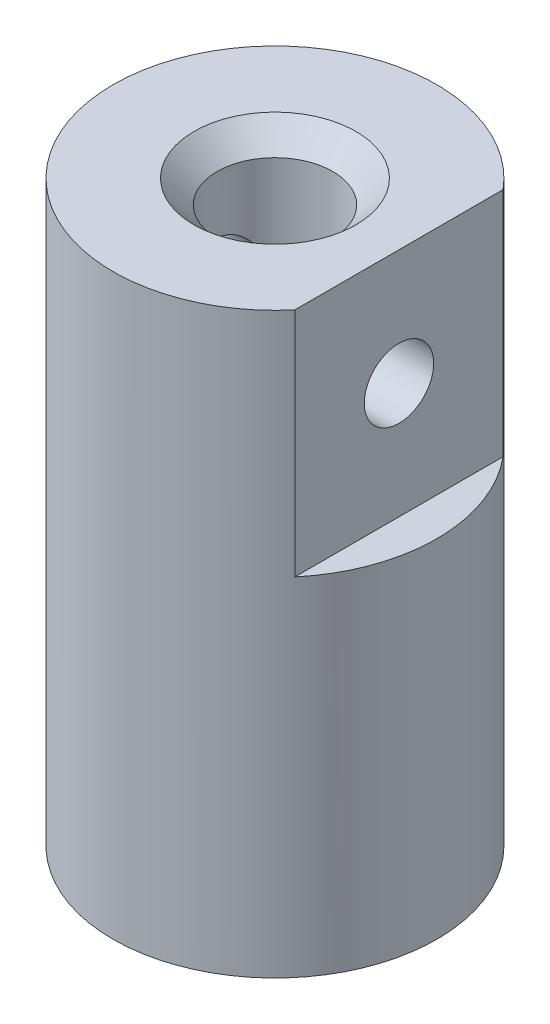
ISO-10303-21;
HEADER;
FILE_DESCRIPTION(('STEP AP214'),'2;1');
FILE_NAME('part.step','',(''),(''),'','','');
FILE_SCHEMA(('AUTOMOTIVE_DESIGN { 1 0 10303 214 1 1 1 1 }'));
ENDSEC;
DATA;
#1=APPLICATION_CONTEXT('core data for automotive mechanical design processes');
#2=APPLICATION_PROTOCOL_DEFINITION('international standard','automotive_design',2000,#1);
#3=PRODUCT_CONTEXT('',#1,'mechanical');
#4=PRODUCT('Part','Part','',(#3));
#5=PRODUCT_RELATED_PRODUCT_CATEGORY('part','',(#4));
#6=PRODUCT_DEFINITION_FORMATION('','',#4);
#7=PRODUCT_DEFINITION_CONTEXT('part definition',#1,'design');
#8=PRODUCT_DEFINITION('design','',#6,#7);
#9=PRODUCT_DEFINITION_SHAPE('','',#8);
#10=(LENGTH_UNIT() NAMED_UNIT(*) SI_UNIT(.MILLI.,.METRE.));
#11=(NAMED_UNIT(*) PLANE_ANGLE_UNIT() SI_UNIT($,.RADIAN.));
#12=(NAMED_UNIT(*) SI_UNIT($,.STERADIAN.) SOLID_ANGLE_UNIT());
#13=UNCERTAINTY_MEASURE_WITH_UNIT(LENGTH_MEASURE(1.E-05),#10,'distance_accuracy_value','');
#14=(GEOMETRIC_REPRESENTATION_CONTEXT(3) GLOBAL_UNCERTAINTY_ASSIGNED_CONTEXT((#13)) GLOBAL_UNIT_ASSIGNED_CONTEXT((#10,
#11,#12)) REPRESENTATION_CONTEXT('',''));
#15=CARTESIAN_POINT('',(0.,0.,0.));
#16=DIRECTION('',(0.,0.,1.));
#17=DIRECTION('',(1.,0.,0.));
#18=AXIS2_PLACEMENT_3D('',#15,#16,#17);
#19=CARTESIAN_POINT('',(0.,25.,0.));
#20=DIRECTION('',(0.,-1.,0.));
#21=DIRECTION('',(0.,0.,-1.));
#22=AXIS2_PLACEMENT_3D('',#19,#20,#21);
#23=CYLINDRICAL_SURFACE('',#22,7.);
#24=CARTESIAN_POINT('',(-7.,18.5,0.));
#25=CARTESIAN_POINT('',(-6.99999846043225,18.5000028995743,-0.0832358860906164));
#26=CARTESIAN_POINT('',(-6.9985002594971,18.5069516083879,-0.166507195600274));
#27=CARTESIAN_POINT('',(-6.99266829827728,18.5345356568536,-0.330687344293327));
#28=CARTESIAN_POINT('',(-6.98833245637099,18.5551810441949,-0.41159440357119));
#29=CARTESIAN_POINT('',(-6.97730831788826,18.609484364608,-0.568649323817737));
#30=CARTESIAN_POINT('',(-6.97062242967171,18.6431289793813,-0.644801963446556));
#31=CARTESIAN_POINT('',(-6.95562106817971,18.7224340861713,-0.790378177960788));
#32=CARTESIAN_POINT('',(-6.9473056503666,18.7680941692499,-0.85980198174737));
#33=CARTESIAN_POINT('',(-6.92981369246311,18.8708802996735,-0.991024790535229));
#34=CARTESIAN_POINT('',(-6.92062683143259,18.9281562218985,-1.05270503419445));
#35=CARTESIAN_POINT('',(-6.90250069814144,19.0522263156852,-1.16566042389435));
#36=CARTESIAN_POINT('',(-6.8935614473163,19.1190213082513,-1.21693467150908));
#37=CARTESIAN_POINT('',(-6.87684116047225,19.2611057528604,-1.30814204379809));
#38=CARTESIAN_POINT('',(-6.8690733634436,19.3364775177562,-1.34794958335009));
#39=CARTESIAN_POINT('',(-6.85572325558537,19.4930344537668,-1.41428823691148));
#40=CARTESIAN_POINT('',(-6.85014069470711,19.5742189584926,-1.44082087001716));
#41=CARTESIAN_POINT('',(-6.8418980892631,19.7388110865881,-1.47946574422455));
#42=CARTESIAN_POINT('',(-6.83919556896486,19.8221672756639,-1.49178779748343));
#43=CARTESIAN_POINT('',(-6.83689139845106,19.989804232507,-1.50231395206577));
#44=CARTESIAN_POINT('',(-6.83728938291729,20.0740848901799,-1.50051971664629));
#45=CARTESIAN_POINT('',(-6.84110276603832,20.2396246879338,-1.48303326340861));
#46=CARTESIAN_POINT('',(-6.84446541682162,20.3209108891002,-1.46758398649408));
#47=CARTESIAN_POINT('',(-6.85374593375787,20.4797102402893,-1.42361054298677));
#48=CARTESIAN_POINT('',(-6.85966393808402,20.5572231860323,-1.39508566936466));
#49=CARTESIAN_POINT('',(-6.87344080755724,20.7069628728733,-1.32554551075991));
#50=CARTESIAN_POINT('',(-6.88131420983365,20.7791445127126,-1.2844361097283));
#51=CARTESIAN_POINT('',(-6.89810572501288,20.915675164958,-1.19096007283993));
#52=CARTESIAN_POINT('',(-6.90702397481896,20.9800231486862,-1.13859196103562));
#53=CARTESIAN_POINT('',(-6.92512718393878,21.1004593556734,-1.0227954275532));
#54=CARTESIAN_POINT('',(-6.93431383972178,21.1563487065847,-0.959160233964411));
#55=CARTESIAN_POINT('',(-6.95175017497059,21.2566937336897,-0.823317306269097));
#56=CARTESIAN_POINT('',(-6.95999983875972,21.3011492186004,-0.7511094287754));
#57=CARTESIAN_POINT('',(-6.97465778534003,21.3774106799069,-0.59993346204996));
#58=CARTESIAN_POINT('',(-6.98106238643354,21.409191412578,-0.520952258863483));
#59=CARTESIAN_POINT('',(-6.99128109245334,21.4589756483211,-0.358603146685707));
#60=CARTESIAN_POINT('',(-6.99509555860384,21.4769810725633,-0.275235851133669));
#61=CARTESIAN_POINT('',(-6.99965306347808,21.4984162141434,-0.10818767083663));
#62=CARTESIAN_POINT('',(-7.00045336521066,21.5021177128818,-0.0245431772716158));
#63=CARTESIAN_POINT('',(-6.99905248935969,21.4955754288748,0.142168973650403));
#64=CARTESIAN_POINT('',(-6.99685150675698,21.4853325520371,0.225236668127253));
#65=CARTESIAN_POINT('',(-6.98973143045266,21.4514177563383,0.387542537982804));
#66=CARTESIAN_POINT('',(-6.98484105045459,21.4278876305275,0.466811712908476));
#67=CARTESIAN_POINT('',(-6.9728892442151,21.3682230570052,0.620278450473417));
#68=CARTESIAN_POINT('',(-6.96582763822237,21.3320875656883,0.694475592587738));
#69=CARTESIAN_POINT('',(-6.950175043904,21.2476664569397,0.836821397964752));
#70=CARTESIAN_POINT('',(-6.94156431354275,21.1992202050903,0.904872575111139));
#71=CARTESIAN_POINT('',(-6.92381033034847,21.0917651751113,1.03197692552359));
#72=CARTESIAN_POINT('',(-6.91466701142097,21.0327550841126,1.091028978692));
#73=CARTESIAN_POINT('',(-6.89668172706324,20.9046026298129,1.19952711057989));
#74=CARTESIAN_POINT('',(-6.88784792221285,20.8352999007779,1.24878537255157));
#75=CARTESIAN_POINT('',(-6.87166654559681,20.689245403522,1.3349641538604));
#76=CARTESIAN_POINT('',(-6.86431891048055,20.6124939530225,1.37188519913705));
#77=CARTESIAN_POINT('',(-6.8520100980739,20.4541277010054,1.43209741248548));
#78=CARTESIAN_POINT('',(-6.84703574582967,20.3725426435693,1.45546398641275));
#79=CARTESIAN_POINT('',(-6.84001186708418,20.2064844161664,1.48812696085335));
#80=CARTESIAN_POINT('',(-6.83796189439706,20.1220116887987,1.49742550780258));
#81=CARTESIAN_POINT('',(-6.83704618848155,19.9544676568248,1.5015999992604));
#82=CARTESIAN_POINT('',(-6.83811476518543,19.8714039850194,1.49677347258311));
#83=CARTESIAN_POINT('',(-6.8431676318483,19.7073027578674,1.47349789406331));
#84=CARTESIAN_POINT('',(-6.84715189026714,19.6262651806134,1.45504898957979));
#85=CARTESIAN_POINT('',(-6.85755581104157,19.4687413421308,1.40519345940434));
#86=CARTESIAN_POINT('',(-6.86396764224703,19.3922413513357,1.37382847170887));
#87=CARTESIAN_POINT('',(-6.87850764590649,19.2455446274931,1.29906751595601));
#88=CARTESIAN_POINT('',(-6.88663598880363,19.175348521385,1.255670353015));
#89=CARTESIAN_POINT('',(-6.90389055593232,19.0417818062746,1.15708290349304));
#90=CARTESIAN_POINT('',(-6.91303309938926,18.978570304053,1.10167987421237));
#91=CARTESIAN_POINT('',(-6.93117449799694,18.8622437374795,0.981086554619621));
#92=CARTESIAN_POINT('',(-6.94017331951296,18.8091310056878,0.915894009385597));
#93=CARTESIAN_POINT('',(-6.95714491048987,18.7138840404944,0.776603147268717));
#94=CARTESIAN_POINT('',(-6.96510364570626,18.671893393769,0.702404846009642));
#95=CARTESIAN_POINT('',(-6.97895826104019,18.6010454710938,0.547850160940598));
#96=CARTESIAN_POINT('',(-6.98485590212342,18.572176977415,0.46749910586388));
#97=CARTESIAN_POINT('',(-6.99284848461772,18.5336478148688,0.322535217553204));
#98=CARTESIAN_POINT('',(-6.99551391888263,18.52105356602,0.258717205545979));
#99=CARTESIAN_POINT('',(-6.99909024154719,18.5042286982883,0.129939960853847));
#100=CARTESIAN_POINT('',(-7.00000120191314,18.4999977363539,0.0649807750887452));
#101=CARTESIAN_POINT('',(-7.,18.5,0.));
#102=B_SPLINE_CURVE_WITH_KNOTS('',3,(#24,#25,#26,#27,#28,#29,#30,#31,#32,#33,#34,#35,#36,#37,
#38,#39,#40,#41,#42,#43,#44,#45,#46,#47,#48,#49,#50,#51,#52,#53,#54,#55,#56,#57,#58,#59,#60,#61,
#62,#63,#64,#65,#66,#67,#68,#69,#70,#71,#72,#73,#74,#75,#76,#77,#78,#79,#80,#81,#82,#83,#84,#85,
#86,#87,#88,#89,#90,#91,#92,#93,#94,#95,#96,#97,#98,#99,#100,#101),.UNSPECIFIED.,.T.,.F.,(4,2,2,
2,2,2,2,2,2,2,2,2,2,2,2,2,2,2,2,2,2,2,2,2,2,2,2,2,2,2,2,2,2,2,2,2,2,2,4),(0.,0.249469836512082,
0.499122883219936,0.748520824425602,0.997910278645885,1.25074961881732,1.50361077918506,
1.7591442921451,2.01464855677489,2.26633008124666,2.51798195169165,2.76524475452928,
3.01252092904568,3.26169356165968,3.51089887920889,3.76527011050291,4.0196455970235,
4.27452521139806,4.52936927256344,4.77934665704185,5.02930780231429,5.27665060589267,
5.52401389198434,5.77478733867803,6.02559197304485,6.28082063283534,6.53603841075805,
6.78982240408474,7.04356767229185,7.29200680540294,7.5404432510827,7.78808499706786,
8.03575134451624,8.28822950154114,8.54076590397115,8.79641910357222,9.05185334010271,
9.24661799132294,9.44137465337336),.UNSPECIFIED.);
#103=CARTESIAN_POINT('',(-7.,18.5,0.));
#104=VERTEX_POINT('',#103);
#105=EDGE_CURVE('E64',#104,#104,#102,.T.);
#106=ORIENTED_EDGE('',*,*,#105,.T.);
#107=EDGE_LOOP('',(#106));
#108=FACE_BOUND('',#107,.T.);
#109=CARTESIAN_POINT('',(0.,25.,0.));
#110=DIRECTION('',(0.,1.,0.));
#111=DIRECTION('',(0.,0.,1.));
#112=AXIS2_PLACEMENT_3D('',#109,#110,#111);
#113=CIRCLE('',#112,7.);
#114=CARTESIAN_POINT('',(5.3619026473818,25.,-4.5));
#115=VERTEX_POINT('',#114);
#116=CARTESIAN_POINT('',(5.3619026473818,25.,4.5));
#117=VERTEX_POINT('',#116);
#118=EDGE_CURVE('E69',#115,#117,#113,.T.);
#119=ORIENTED_EDGE('',*,*,#118,.F.);
#120=DIRECTION('',(0.,1.,0.));
#121=VECTOR('',#120,1.);
#122=CARTESIAN_POINT('',(5.3619026473818,15.,-4.5));
#123=LINE('',#122,#121);
#124=CARTESIAN_POINT('',(5.3619026473818,15.,-4.5));
#125=VERTEX_POINT('',#124);
#126=EDGE_CURVE('E47',#125,#115,#123,.T.);
#127=ORIENTED_EDGE('',*,*,#126,.F.);
#128=CARTESIAN_POINT('',(0.,15.,0.));
#129=DIRECTION('',(0.,1.,0.));
#130=DIRECTION('',(0.,0.,1.));
#131=AXIS2_PLACEMENT_3D('',#128,#129,#130);
#132=CIRCLE('',#131,7.);
#133=CARTESIAN_POINT('',(5.3619026473818,15.,4.5));
#134=VERTEX_POINT('',#133);
#135=EDGE_CURVE('E63',#134,#125,#132,.T.);
#136=ORIENTED_EDGE('',*,*,#135,.F.);
#137=DIRECTION('',(0.,1.,0.));
#138=VECTOR('',#137,1.);
#139=CARTESIAN_POINT('',(5.3619026473818,15.,4.5));
#140=LINE('',#139,#138);
#141=EDGE_CURVE('E53',#134,#117,#140,.T.);
#142=ORIENTED_EDGE('',*,*,#141,.T.);
#143=EDGE_LOOP('',(#119,#127,#136,#142));
#144=FACE_BOUND('',#143,.T.);
#145=CARTESIAN_POINT('',(0.,0.,0.));
#146=DIRECTION('',(0.,1.,0.));
#147=DIRECTION('',(0.,0.,1.));
#148=AXIS2_PLACEMENT_3D('',#145,#146,#147);
#149=CIRCLE('',#148,7.);
#150=CARTESIAN_POINT('',(0.,0.,7.));
#151=VERTEX_POINT('',#150);
#152=EDGE_CURVE('E70',#151,#151,#149,.T.);
#153=ORIENTED_EDGE('',*,*,#152,.T.);
#154=EDGE_LOOP('',(#153));
#155=FACE_BOUND('',#154,.T.);
#156=ADVANCED_FACE('F32',(#108,#144,#155),#23,.T.);
#157=CARTESIAN_POINT('',(0.,25.,0.));
#158=DIRECTION('',(0.,1.,0.));
#159=DIRECTION('',(0.,0.,1.));
#160=AXIS2_PLACEMENT_3D('',#157,#158,#159);
#161=PLANE('',#160);
#162=DIRECTION('',(0.,0.,1.));
#163=VECTOR('',#162,1.);
#164=CARTESIAN_POINT('',(5.3619026473818,25.,0.));
#165=LINE('',#164,#163);
#166=EDGE_CURVE('E58',#115,#117,#165,.T.);
#167=ORIENTED_EDGE('',*,*,#166,.F.);
#168=ORIENTED_EDGE('',*,*,#118,.T.);
#169=EDGE_LOOP('',(#167,#168));
#170=FACE_BOUND('',#169,.T.);
#171=CARTESIAN_POINT('',(0.,25.,0.));
#172=DIRECTION('',(0.,1.,0.));
#173=DIRECTION('',(0.,0.,1.));
#174=AXIS2_PLACEMENT_3D('',#171,#172,#173);
#175=CIRCLE('',#174,3.49999999999999);
#176=CARTESIAN_POINT('',(0.,25.,3.49999999999999));
#177=VERTEX_POINT('',#176);
#178=EDGE_CURVE('E40',#177,#177,#175,.F.);
#179=ORIENTED_EDGE('',*,*,#178,.T.);
#180=EDGE_LOOP('',(#179));
#181=FACE_BOUND('',#180,.T.);
#182=ADVANCED_FACE('F72',(#170,#181),#161,.T.);
#183=CARTESIAN_POINT('',(0.,0.,0.));
#184=DIRECTION('',(0.,1.,0.));
#185=DIRECTION('',(0.,0.,1.));
#186=AXIS2_PLACEMENT_3D('',#183,#184,#185);
#187=PLANE('',#186);
#188=CARTESIAN_POINT('',(0.,0.,0.));
#189=DIRECTION('',(0.,1.,0.));
#190=DIRECTION('',(0.,0.,1.));
#191=AXIS2_PLACEMENT_3D('',#188,#189,#190);
#192=CIRCLE('',#191,3.00000000000001);
#193=CARTESIAN_POINT('',(0.,0.,3.00000000000001));
#194=VERTEX_POINT('',#193);
#195=EDGE_CURVE('E77',#194,#194,#192,.T.);
#196=ORIENTED_EDGE('',*,*,#195,.T.);
#197=EDGE_LOOP('',(#196));
#198=FACE_BOUND('',#197,.T.);
#199=ORIENTED_EDGE('',*,*,#152,.F.);
#200=EDGE_LOOP('',(#199));
#201=FACE_BOUND('',#200,.T.);
#202=ADVANCED_FACE('F106',(#198,#201),#187,.F.);
#203=CARTESIAN_POINT('',(0.,25.001,0.));
#204=DIRECTION('',(0.,-1.,0.));
#205=DIRECTION('',(0.,0.,-1.));
#206=AXIS2_PLACEMENT_3D('',#203,#204,#205);
#207=CYLINDRICAL_SURFACE('',#206,2.5);
#208=CARTESIAN_POINT('',(-2.,20.,-1.5));
#209=CARTESIAN_POINT('',(-1.99999416642511,19.9245210247104,-1.50000404108592));
#210=CARTESIAN_POINT('',(-2.00433633903481,19.8490615659202,-1.49426852824014));
#211=CARTESIAN_POINT('',(-2.02092590613883,19.7006760960378,-1.47174965152787));
#212=CARTESIAN_POINT('',(-2.03318155043097,19.6277528126149,-1.45495475788936));
#213=CARTESIAN_POINT('',(-2.0636233903473,19.4869163583227,-1.41143486335796));
#214=CARTESIAN_POINT('',(-2.08176666183119,19.4189711619647,-1.3847815450315));
#215=CARTESIAN_POINT('',(-2.12185904995836,19.2885625466321,-1.3225290928302));
#216=CARTESIAN_POINT('',(-2.14380930122416,19.2261007703049,-1.28692729054694));
#217=CARTESIAN_POINT('',(-2.19228594587542,19.1000509833359,-1.20271292747644));
#218=CARTESIAN_POINT('',(-2.21904371037662,19.0372590428761,-1.15304179435289));
#219=CARTESIAN_POINT('',(-2.27226229431061,18.9202352372582,-1.04426801309985));
#220=CARTESIAN_POINT('',(-2.29872287517103,18.8660098483292,-0.985158296729612));
#221=CARTESIAN_POINT('',(-2.35175567858734,18.7618661902903,-0.851442367411701));
#222=CARTESIAN_POINT('',(-2.37803133577818,18.7130455363302,-0.775851995162548));
#223=CARTESIAN_POINT('',(-2.42443786983179,18.6291902775556,-0.615654228271659));
#224=CARTESIAN_POINT('',(-2.44457437988735,18.5941430258773,-0.531055196626331));
#225=CARTESIAN_POINT('',(-2.4747098780044,18.5424040771874,-0.363771406742668));
#226=CARTESIAN_POINT('',(-2.4854930393917,18.5242796390327,-0.281674698130917));
#227=CARTESIAN_POINT('',(-2.49874939277545,18.5020571971369,-0.114970509382709));
#228=CARTESIAN_POINT('',(-2.50123038813307,18.4979460219999,-0.0303654624001545));
#229=CARTESIAN_POINT('',(-2.49783372711539,18.5036137473425,0.127637283737309));
#230=CARTESIAN_POINT('',(-2.49295437513726,18.5117335261693,0.201123832865634));
#231=CARTESIAN_POINT('',(-2.47707997553857,18.5384797956481,0.345464269151767));
#232=CARTESIAN_POINT('',(-2.46608447529309,18.5571070639072,0.416317961051201));
#233=CARTESIAN_POINT('',(-2.43884907201719,18.6041655627038,0.554056780469079));
#234=CARTESIAN_POINT('',(-2.42257910450824,18.632653061139,0.620916491037618));
#235=CARTESIAN_POINT('',(-2.38609637638748,18.6983846162255,0.748988660115612));
#236=CARTESIAN_POINT('',(-2.36588259201812,18.735630947059,0.810199646208011));
#237=CARTESIAN_POINT('',(-2.32037925976363,18.8228390928045,0.933074267143199));
#238=CARTESIAN_POINT('',(-2.2947718295215,18.8737883117357,0.993918663198192));
#239=CARTESIAN_POINT('',(-2.24255554245601,18.9844041178602,1.10671465909274));
#240=CARTESIAN_POINT('',(-2.21594536703375,19.0440825034745,1.15865401308339));
#241=CARTESIAN_POINT('',(-2.16111075123946,19.1786534061636,1.25824837767417));
#242=CARTESIAN_POINT('',(-2.13305661385124,19.2545075765395,1.30470933188632));
#243=CARTESIAN_POINT('',(-2.08250879557267,19.4147062316366,1.38397217194232));
#244=CARTESIAN_POINT('',(-2.0600049029882,19.4990347161256,1.41679921962189));
#245=CARTESIAN_POINT('',(-2.02895865196731,19.6523936318954,1.46077497064842));
#246=CARTESIAN_POINT('',(-2.01833888618316,19.7200406322966,1.47527903312665));
#247=CARTESIAN_POINT('',(-2.00392150777558,19.8573736102995,1.49480872755284));
#248=CARTESIAN_POINT('',(-2.00011596115116,19.9270571204846,1.49984538302907));
#249=CARTESIAN_POINT('',(-1.99988914321323,20.0665516824357,1.50014781114183));
#250=CARTESIAN_POINT('',(-2.00347810223984,20.1363627772152,1.49540004697659));
#251=CARTESIAN_POINT('',(-2.01751520788652,20.2739873437486,1.47640290574941));
#252=CARTESIAN_POINT('',(-2.02796877613213,20.3417991922403,1.46214601830139));
#253=CARTESIAN_POINT('',(-2.054317683331,20.4737145794798,1.42488312618657));
#254=CARTESIAN_POINT('',(-2.07020622092812,20.5378226365322,1.40188805257362));
#255=CARTESIAN_POINT('',(-2.10571539417587,20.6614777157302,1.34796261057072));
#256=CARTESIAN_POINT('',(-2.12533743689999,20.721023006366,1.31702924888212));
#257=CARTESIAN_POINT('',(-2.17036819177737,20.8452400825123,1.24167439558512));
#258=CARTESIAN_POINT('',(-2.19618239397369,20.9089008350966,1.19582663060302));
#259=CARTESIAN_POINT('',(-2.24821754803621,21.0282854848495,1.094873955187));
#260=CARTESIAN_POINT('',(-2.27443886711455,21.0840016921691,1.03976018672402));
#261=CARTESIAN_POINT('',(-2.32835625910913,21.1932240073504,0.913274837212764));
#262=CARTESIAN_POINT('',(-2.3558007587587,21.2455007266058,0.840721108780188));
#263=CARTESIAN_POINT('',(-2.40537639133459,21.3369027768367,0.686103100868015));
#264=CARTESIAN_POINT('',(-2.42751104449411,21.3760368278409,0.604045176134697));
#265=CARTESIAN_POINT('',(-2.46252280092775,21.4368682034314,0.438840232972132));
#266=CARTESIAN_POINT('',(-2.47595588067329,21.4596262277911,0.356205963651252));
#267=CARTESIAN_POINT('',(-2.494407389061,21.4907146028463,0.187383063890851));
#268=CARTESIAN_POINT('',(-2.49943534582737,21.4990612907176,0.101198571781962));
#269=CARTESIAN_POINT('',(-2.50040600461976,21.5006746085859,-0.0598120232009899));
#270=CARTESIAN_POINT('',(-2.49747057186327,21.495803334563,-0.134620583589712));
#271=CARTESIAN_POINT('',(-2.48512948412095,21.4751061756184,-0.282148755978779));
#272=CARTESIAN_POINT('',(-2.47572375706639,21.4592801686784,-0.354868344701919));
#273=CARTESIAN_POINT('',(-2.45149427526962,21.4177804284162,-0.495145481978802));
#274=CARTESIAN_POINT('',(-2.43675966858906,21.3922684038708,-0.562767032608834));
#275=CARTESIAN_POINT('',(-2.40303337447155,21.3323594054452,-0.692781971999988));
#276=CARTESIAN_POINT('',(-2.38404073252268,21.2979604391404,-0.755174184199836));
#277=CARTESIAN_POINT('',(-2.3409343265938,21.2170748034312,-0.880263645295952));
#278=CARTESIAN_POINT('',(-2.31648844639149,21.1696812909831,-0.942258690439945));
#279=CARTESIAN_POINT('',(-2.26601907350661,21.0662469662823,-1.05789751536307));
#280=CARTESIAN_POINT('',(-2.23999385274509,21.0101965743921,-1.11153190956916));
#281=CARTESIAN_POINT('',(-2.18528165666204,20.8827144378223,-1.2159097535057));
#282=CARTESIAN_POINT('',(-2.15667566270901,20.8102335138345,-1.26542406663368));
#283=CARTESIAN_POINT('',(-2.10376464485145,20.6565151472335,-1.35156817210325));
#284=CARTESIAN_POINT('',(-2.07945738811052,20.5752822860186,-1.38820466322661));
#285=CARTESIAN_POINT('',(-2.0408000304796,20.4129357148628,-1.44437116535132));
#286=CARTESIAN_POINT('',(-2.02577665830138,20.3324047640387,-1.46509526060187));
#287=CARTESIAN_POINT('',(-2.00539032320036,20.1679026052963,-1.49289268240426));
#288=CARTESIAN_POINT('',(-2.00000648744643,20.0839392342413,-1.49999550595837));
#289=CARTESIAN_POINT('',(-2.,20.,-1.5));
#290=B_SPLINE_CURVE_WITH_KNOTS('',3,(#208,#209,#210,#211,#212,#213,#214,#215,#216,#217,#218,
#219,#220,#221,#222,#223,#224,#225,#226,#227,#228,#229,#230,#231,#232,#233,#234,#235,#236,#237,
#238,#239,#240,#241,#242,#243,#244,#245,#246,#247,#248,#249,#250,#251,#252,#253,#254,#255,#256,
#257,#258,#259,#260,#261,#262,#263,#264,#265,#266,#267,#268,#269,#270,#271,#272,#273,#274,#275,
#276,#277,#278,#279,#280,#281,#282,#283,#284,#285,#286,#287,#288,#289),.UNSPECIFIED.,.T.,.F.,(4,
2,2,2,2,2,2,2,2,2,2,2,2,2,2,2,2,2,2,2,2,2,2,2,2,2,2,2,2,2,2,2,2,2,2,2,2,2,2,2,4),(0.,
0.22608524949339,0.452406574330771,0.677113624991876,0.90188776221593,1.15414462390002,
1.40659128601844,1.68630157736223,1.9657544327122,2.21853330858497,2.47107452602767,
2.69230130543182,2.91354445887945,3.13607155036377,3.35865648368878,3.60782810055849,
3.85733966656908,4.13576671140276,4.41367760154768,4.62276298054684,4.83160475643977,
5.04073566011182,5.25003193304128,5.45906724365496,5.66818149154662,5.91499438482003,
6.16204457978455,6.44121828011589,6.72020638384848,6.97891479383338,7.23732973022727,
7.461293218494,7.68525920139649,7.90563970188757,8.12606965394585,8.37042963549488,
8.61506198741956,8.89071695766605,9.16622832484806,9.41820120134354,9.66962780912277),.UNSPECIFIED.);
#291=CARTESIAN_POINT('',(-2.,20.,-1.5));
#292=VERTEX_POINT('',#291);
#293=EDGE_CURVE('E117',#292,#292,#290,.T.);
#294=ORIENTED_EDGE('',*,*,#293,.T.);
#295=EDGE_LOOP('',(#294));
#296=FACE_BOUND('',#295,.T.);
#297=CARTESIAN_POINT('',(2.,20.,-1.5));
#298=CARTESIAN_POINT('',(1.99999416642511,20.0754789752896,-1.50000404108592));
#299=CARTESIAN_POINT('',(2.00433633903481,20.1509384340798,-1.49426852824014));
#300=CARTESIAN_POINT('',(2.02092590613883,20.2993239039622,-1.47174965152787));
#301=CARTESIAN_POINT('',(2.03318155043097,20.3722471873851,-1.45495475788936));
#302=CARTESIAN_POINT('',(2.0636233903473,20.5130836416773,-1.41143486335796));
#303=CARTESIAN_POINT('',(2.08176666183119,20.5810288380353,-1.3847815450315));
#304=CARTESIAN_POINT('',(2.12185904995836,20.7114374533679,-1.3225290928302));
#305=CARTESIAN_POINT('',(2.14380930122416,20.7738992296951,-1.28692729054694));
#306=CARTESIAN_POINT('',(2.19228594587542,20.8999490166641,-1.20271292747644));
#307=CARTESIAN_POINT('',(2.21904371037662,20.9627409571239,-1.15304179435289));
#308=CARTESIAN_POINT('',(2.27226229431061,21.0797647627418,-1.04426801309985));
#309=CARTESIAN_POINT('',(2.29872287517103,21.1339901516708,-0.985158296729613));
#310=CARTESIAN_POINT('',(2.35175567858734,21.2381338097097,-0.851442367411701));
#311=CARTESIAN_POINT('',(2.37803133577818,21.2869544636698,-0.775851995162548));
#312=CARTESIAN_POINT('',(2.42443786983179,21.3708097224444,-0.615654228271659));
#313=CARTESIAN_POINT('',(2.44457437988735,21.4058569741227,-0.531055196626331));
#314=CARTESIAN_POINT('',(2.4747098780044,21.4575959228126,-0.363771406742668));
#315=CARTESIAN_POINT('',(2.4854930393917,21.4757203609673,-0.281674698130917));
#316=CARTESIAN_POINT('',(2.49874939277545,21.4979428028631,-0.114970509382709));
#317=CARTESIAN_POINT('',(2.50123038813307,21.5020539780001,-0.0303654624001545));
#318=CARTESIAN_POINT('',(2.49783372711539,21.4963862526575,0.127637283737309));
#319=CARTESIAN_POINT('',(2.49295437513726,21.4882664738307,0.201123832865635));
#320=CARTESIAN_POINT('',(2.47707997553857,21.4615202043519,0.345464269151768));
#321=CARTESIAN_POINT('',(2.46608447529309,21.4428929360928,0.416317961051201));
#322=CARTESIAN_POINT('',(2.43884907201719,21.3958344372962,0.554056780469079));
#323=CARTESIAN_POINT('',(2.42257910450824,21.367346938861,0.620916491037618));
#324=CARTESIAN_POINT('',(2.38609637638748,21.3016153837745,0.748988660115612));
#325=CARTESIAN_POINT('',(2.36588259201812,21.264369052941,0.810199646208011));
#326=CARTESIAN_POINT('',(2.32037925976363,21.1771609071955,0.933074267143199));
#327=CARTESIAN_POINT('',(2.2947718295215,21.1262116882643,0.993918663198192));
#328=CARTESIAN_POINT('',(2.24255554245601,21.0155958821398,1.10671465909274));
#329=CARTESIAN_POINT('',(2.21594536703375,20.9559174965255,1.15865401308339));
#330=CARTESIAN_POINT('',(2.16111075123946,20.8213465938364,1.25824837767417));
#331=CARTESIAN_POINT('',(2.13305661385124,20.7454924234605,1.30470933188632));
#332=CARTESIAN_POINT('',(2.08250879557267,20.5852937683634,1.38397217194232));
#333=CARTESIAN_POINT('',(2.0600049029882,20.5009652838744,1.41679921962189));
#334=CARTESIAN_POINT('',(2.02895865196731,20.3476063681047,1.46077497064842));
#335=CARTESIAN_POINT('',(2.01833888618316,20.2799593677034,1.47527903312665));
#336=CARTESIAN_POINT('',(2.00392150777558,20.1426263897005,1.49480872755284));
#337=CARTESIAN_POINT('',(2.00011596115116,20.0729428795154,1.49984538302907));
#338=CARTESIAN_POINT('',(1.99988914321323,19.9334483175643,1.50014781114183));
#339=CARTESIAN_POINT('',(2.00347810223984,19.8636372227848,1.49540004697659));
#340=CARTESIAN_POINT('',(2.01751520788652,19.7260126562514,1.47640290574941));
#341=CARTESIAN_POINT('',(2.02796877613213,19.6582008077597,1.46214601830139));
#342=CARTESIAN_POINT('',(2.054317683331,19.5262854205202,1.42488312618657));
#343=CARTESIAN_POINT('',(2.07020622092812,19.4621773634678,1.40188805257362));
#344=CARTESIAN_POINT('',(2.10571539417587,19.3385222842698,1.34796261057072));
#345=CARTESIAN_POINT('',(2.12533743689999,19.278976993634,1.31702924888212));
#346=CARTESIAN_POINT('',(2.17036819177737,19.1547599174877,1.24167439558512));
#347=CARTESIAN_POINT('',(2.19618239397369,19.0910991649034,1.19582663060302));
#348=CARTESIAN_POINT('',(2.24821754803621,18.9717145151505,1.094873955187));
#349=CARTESIAN_POINT('',(2.27443886711455,18.9159983078309,1.03976018672402));
#350=CARTESIAN_POINT('',(2.32835625910913,18.8067759926496,0.913274837212764));
#351=CARTESIAN_POINT('',(2.3558007587587,18.7544992733942,0.840721108780188));
#352=CARTESIAN_POINT('',(2.40537639133459,18.6630972231633,0.686103100868015));
#353=CARTESIAN_POINT('',(2.42751104449411,18.6239631721591,0.604045176134697));
#354=CARTESIAN_POINT('',(2.46252280092775,18.5631317965686,0.438840232972132));
#355=CARTESIAN_POINT('',(2.47595588067329,18.5403737722089,0.356205963651252));
#356=CARTESIAN_POINT('',(2.494407389061,18.5092853971537,0.18738306389085));
#357=CARTESIAN_POINT('',(2.49943534582737,18.5009387092824,0.101198571781962));
#358=CARTESIAN_POINT('',(2.50040600461976,18.4993253914141,-0.0598120232009899));
#359=CARTESIAN_POINT('',(2.49747057186327,18.504196665437,-0.134620583589712));
#360=CARTESIAN_POINT('',(2.48512948412095,18.5248938243816,-0.282148755978779));
#361=CARTESIAN_POINT('',(2.47572375706639,18.5407198313216,-0.354868344701919));
#362=CARTESIAN_POINT('',(2.45149427526962,18.5822195715838,-0.495145481978801));
#363=CARTESIAN_POINT('',(2.43675966858906,18.6077315961292,-0.562767032608833));
#364=CARTESIAN_POINT('',(2.40303337447155,18.6676405945548,-0.692781971999987));
#365=CARTESIAN_POINT('',(2.38404073252268,18.7020395608596,-0.755174184199836));
#366=CARTESIAN_POINT('',(2.3409343265938,18.7829251965688,-0.880263645295952));
#367=CARTESIAN_POINT('',(2.31648844639149,18.8303187090169,-0.942258690439945));
#368=CARTESIAN_POINT('',(2.26601907350661,18.9337530337177,-1.05789751536307));
#369=CARTESIAN_POINT('',(2.23999385274509,18.9898034256079,-1.11153190956916));
#370=CARTESIAN_POINT('',(2.18528165666204,19.1172855621777,-1.2159097535057));
#371=CARTESIAN_POINT('',(2.15667566270901,19.1897664861655,-1.26542406663368));
#372=CARTESIAN_POINT('',(2.10376464485145,19.3434848527665,-1.35156817210325));
#373=CARTESIAN_POINT('',(2.07945738811052,19.4247177139814,-1.38820466322661));
#374=CARTESIAN_POINT('',(2.0408000304796,19.5870642851372,-1.44437116535132));
#375=CARTESIAN_POINT('',(2.02577665830138,19.6675952359613,-1.46509526060187));
#376=CARTESIAN_POINT('',(2.00539032320036,19.8320973947037,-1.49289268240426));
#377=CARTESIAN_POINT('',(2.00000648744643,19.9160607657587,-1.49999550595837));
#378=CARTESIAN_POINT('',(2.,20.,-1.5));
#379=B_SPLINE_CURVE_WITH_KNOTS('',3,(#297,#298,#299,#300,#301,#302,#303,#304,#305,#306,#307,
#308,#309,#310,#311,#312,#313,#314,#315,#316,#317,#318,#319,#320,#321,#322,#323,#324,#325,#326,
#327,#328,#329,#330,#331,#332,#333,#334,#335,#336,#337,#338,#339,#340,#341,#342,#343,#344,#345,
#346,#347,#348,#349,#350,#351,#352,#353,#354,#355,#356,#357,#358,#359,#360,#361,#362,#363,#364,
#365,#366,#367,#368,#369,#370,#371,#372,#373,#374,#375,#376,#377,#378),.UNSPECIFIED.,.T.,.F.,(4,
2,2,2,2,2,2,2,2,2,2,2,2,2,2,2,2,2,2,2,2,2,2,2,2,2,2,2,2,2,2,2,2,2,2,2,2,2,2,2,4),(0.,
0.22608524949339,0.452406574330771,0.677113624991876,0.90188776221593,1.15414462390001,
1.40659128601844,1.68630157736223,1.9657544327122,2.21853330858497,2.47107452602767,
2.69230130543182,2.91354445887945,3.13607155036377,3.35865648368878,3.60782810055849,
3.85733966656908,4.13576671140276,4.41367760154768,4.62276298054684,4.83160475643977,
5.04073566011182,5.25003193304128,5.45906724365495,5.66818149154662,5.91499438482003,
6.16204457978455,6.44121828011589,6.72020638384848,6.97891479383338,7.23732973022727,
7.461293218494,7.68525920139649,7.90563970188756,8.12606965394585,8.37042963549488,
8.61506198741955,8.89071695766605,9.16622832484806,9.41820120134354,9.66962780912277),.UNSPECIFIED.);
#380=CARTESIAN_POINT('',(2.,20.,-1.5));
#381=VERTEX_POINT('',#380);
#382=EDGE_CURVE('E131',#381,#381,#379,.T.);
#383=ORIENTED_EDGE('',*,*,#382,.T.);
#384=EDGE_LOOP('',(#383));
#385=FACE_BOUND('',#384,.T.);
#386=CARTESIAN_POINT('',(0.,24.,0.));
#387=DIRECTION('',(0.,1.,0.));
#388=DIRECTION('',(0.,0.,1.));
#389=AXIS2_PLACEMENT_3D('',#386,#387,#388);
#390=CIRCLE('',#389,2.5);
#391=CARTESIAN_POINT('',(0.,24.,2.5));
#392=VERTEX_POINT('',#391);
#393=EDGE_CURVE('E11',#392,#392,#390,.T.);
#394=ORIENTED_EDGE('',*,*,#393,.T.);
#395=EDGE_LOOP('',(#394));
#396=FACE_BOUND('',#395,.T.);
#397=CARTESIAN_POINT('',(0.,0.5,0.));
#398=DIRECTION('',(0.,1.,0.));
#399=DIRECTION('',(0.,0.,1.));
#400=AXIS2_PLACEMENT_3D('',#397,#398,#399);
#401=CIRCLE('',#400,2.5);
#402=CARTESIAN_POINT('',(0.,0.5,2.5));
#403=VERTEX_POINT('',#402);
#404=EDGE_CURVE('E74',#403,#403,#401,.F.);
#405=ORIENTED_EDGE('',*,*,#404,.T.);
#406=EDGE_LOOP('',(#405));
#407=FACE_BOUND('',#406,.T.);
#408=ADVANCED_FACE('F97',(#296,#385,#396,#407),#207,.F.);
#409=CARTESIAN_POINT('',(0.,0.5,0.));
#410=DIRECTION('',(0.,-1.,0.));
#411=DIRECTION('',(0.,0.,-1.));
#412=AXIS2_PLACEMENT_3D('',#409,#410,#411);
#413=CONICAL_SURFACE('',#412,2.5,0.785398163397454);
#414=ORIENTED_EDGE('',*,*,#195,.F.);
#415=EDGE_LOOP('',(#414));
#416=FACE_BOUND('',#415,.T.);
#417=ORIENTED_EDGE('',*,*,#404,.F.);
#418=EDGE_LOOP('',(#417));
#419=FACE_BOUND('',#418,.T.);
#420=ADVANCED_FACE('F88',(#416,#419),#413,.F.);
#421=CARTESIAN_POINT('',(0.,25.,0.));
#422=DIRECTION('',(0.,1.,0.));
#423=DIRECTION('',(0.,0.,1.));
#424=AXIS2_PLACEMENT_3D('',#421,#422,#423);
#425=CONICAL_SURFACE('',#424,3.49999999999999,0.785398163397446);
#426=ORIENTED_EDGE('',*,*,#393,.F.);
#427=EDGE_LOOP('',(#426));
#428=FACE_BOUND('',#427,.T.);
#429=ORIENTED_EDGE('',*,*,#178,.F.);
#430=EDGE_LOOP('',(#429));
#431=FACE_BOUND('',#430,.T.);
#432=ADVANCED_FACE('F34',(#428,#431),#425,.F.);
#433=CARTESIAN_POINT('',(5.3619026473818,15.,0.));
#434=DIRECTION('',(-1.,0.,0.));
#435=DIRECTION('',(0.,0.,1.));
#436=AXIS2_PLACEMENT_3D('',#433,#434,#435);
#437=PLANE('',#436);
#438=CARTESIAN_POINT('',(5.3619026473818,20.,0.));
#439=DIRECTION('',(1.,0.,0.));
#440=DIRECTION('',(0.,0.,-1.));
#441=AXIS2_PLACEMENT_3D('',#438,#439,#440);
#442=CIRCLE('',#441,1.5);
#443=CARTESIAN_POINT('',(5.3619026473818,20.,-1.5));
#444=VERTEX_POINT('',#443);
#445=EDGE_CURVE('E136',#444,#444,#442,.T.);
#446=ORIENTED_EDGE('',*,*,#445,.F.);
#447=EDGE_LOOP('',(#446));
#448=FACE_BOUND('',#447,.T.);
#449=ORIENTED_EDGE('',*,*,#166,.T.);
#450=ORIENTED_EDGE('',*,*,#141,.F.);
#451=DIRECTION('',(0.,0.,1.));
#452=VECTOR('',#451,1.);
#453=CARTESIAN_POINT('',(5.3619026473818,15.,0.));
#454=LINE('',#453,#452);
#455=EDGE_CURVE('E164',#125,#134,#454,.T.);
#456=ORIENTED_EDGE('',*,*,#455,.F.);
#457=ORIENTED_EDGE('',*,*,#126,.T.);
#458=EDGE_LOOP('',(#449,#450,#456,#457));
#459=FACE_BOUND('',#458,.T.);
#460=ADVANCED_FACE('F59',(#448,#459),#437,.F.);
#461=CARTESIAN_POINT('',(0.,15.,0.));
#462=DIRECTION('',(0.,1.,0.));
#463=DIRECTION('',(0.,0.,1.));
#464=AXIS2_PLACEMENT_3D('',#461,#462,#463);
#465=PLANE('',#464);
#466=ORIENTED_EDGE('',*,*,#135,.T.);
#467=ORIENTED_EDGE('',*,*,#455,.T.);
#468=EDGE_LOOP('',(#466,#467));
#469=FACE_BOUND('',#468,.T.);
#470=ADVANCED_FACE('F94',(#469),#465,.T.);
#471=CARTESIAN_POINT('',(-7.,20.,0.));
#472=DIRECTION('',(1.,0.,0.));
#473=DIRECTION('',(0.,0.,-1.));
#474=AXIS2_PLACEMENT_3D('',#471,#472,#473);
#475=CYLINDRICAL_SURFACE('',#474,1.5);
#476=ORIENTED_EDGE('',*,*,#445,.T.);
#477=EDGE_LOOP('',(#476));
#478=FACE_BOUND('',#477,.T.);
#479=ORIENTED_EDGE('',*,*,#382,.F.);
#480=EDGE_LOOP('',(#479));
#481=FACE_BOUND('',#480,.T.);
#482=ADVANCED_FACE('F127',(#478,#481),#475,.F.);
#483=ORIENTED_EDGE('',*,*,#293,.F.);
#484=EDGE_LOOP('',(#483));
#485=FACE_BOUND('',#484,.T.);
#486=ORIENTED_EDGE('',*,*,#105,.F.);
#487=EDGE_LOOP('',(#486));
#488=FACE_BOUND('',#487,.T.);
#489=ADVANCED_FACE('F123',(#485,#488),#475,.F.);
#490=CLOSED_SHELL('',(#156,#182,#202,#408,#420,#432,#460,#470,#482,#489));
#491=MANIFOLD_SOLID_BREP('B2',#490);
#492=ADVANCED_BREP_SHAPE_REPRESENTATION('',(#18,#491),#14);
#493=SHAPE_DEFINITION_REPRESENTATION(#9,#492);
ENDSEC;
END-ISO-10303-21;
